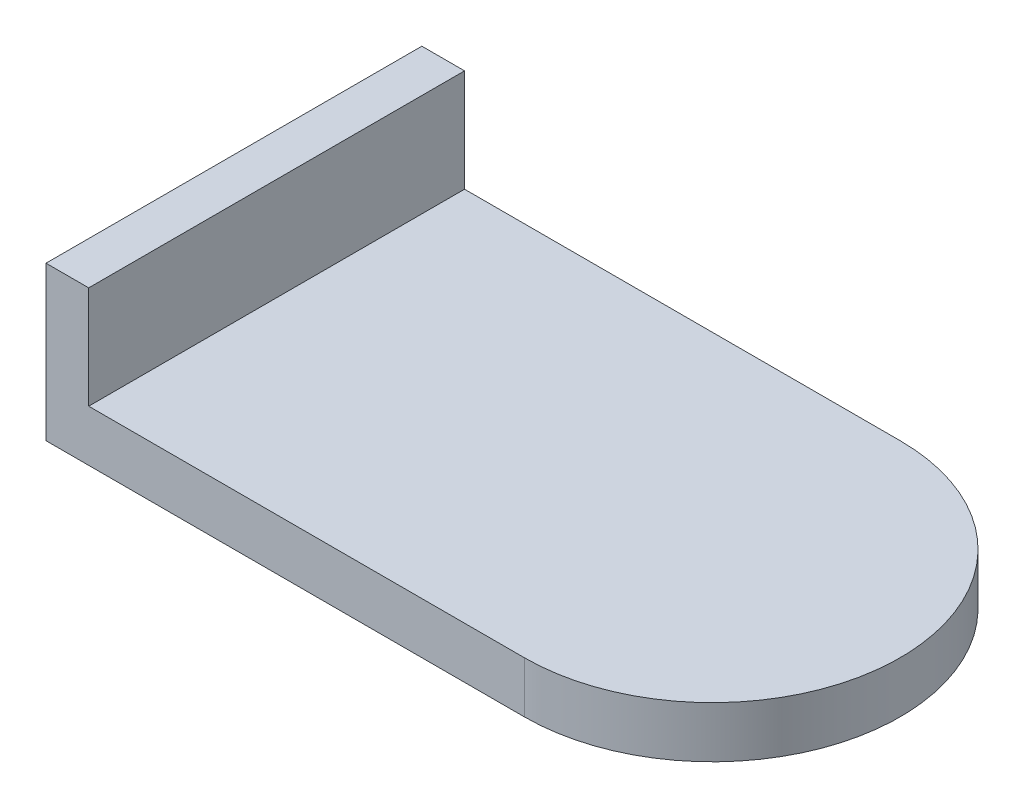
ISO-10303-21;
HEADER;
FILE_DESCRIPTION(('STEP AP214'),'2;1');
FILE_NAME('part.step','',(''),(''),'','','');
FILE_SCHEMA(('AUTOMOTIVE_DESIGN { 1 0 10303 214 1 1 1 1 }'));
ENDSEC;
DATA;
#1=APPLICATION_CONTEXT('core data for automotive mechanical design processes');
#2=APPLICATION_PROTOCOL_DEFINITION('international standard','automotive_design',2000,#1);
#3=PRODUCT_CONTEXT('',#1,'mechanical');
#4=PRODUCT('Part','Part','',(#3));
#5=PRODUCT_RELATED_PRODUCT_CATEGORY('part','',(#4));
#6=PRODUCT_DEFINITION_FORMATION('','',#4);
#7=PRODUCT_DEFINITION_CONTEXT('part definition',#1,'design');
#8=PRODUCT_DEFINITION('design','',#6,#7);
#9=PRODUCT_DEFINITION_SHAPE('','',#8);
#10=(LENGTH_UNIT() NAMED_UNIT(*) SI_UNIT(.MILLI.,.METRE.));
#11=(NAMED_UNIT(*) PLANE_ANGLE_UNIT() SI_UNIT($,.RADIAN.));
#12=(NAMED_UNIT(*) SI_UNIT($,.STERADIAN.) SOLID_ANGLE_UNIT());
#13=UNCERTAINTY_MEASURE_WITH_UNIT(LENGTH_MEASURE(1.E-05),#10,'distance_accuracy_value','');
#14=(GEOMETRIC_REPRESENTATION_CONTEXT(3) GLOBAL_UNCERTAINTY_ASSIGNED_CONTEXT((#13)) GLOBAL_UNIT_ASSIGNED_CONTEXT((#10,
#11,#12)) REPRESENTATION_CONTEXT('',''));
#15=CARTESIAN_POINT('',(0.,0.,0.));
#16=DIRECTION('',(0.,0.,1.));
#17=DIRECTION('',(1.,0.,0.));
#18=AXIS2_PLACEMENT_3D('',#15,#16,#17);
#19=CARTESIAN_POINT('',(14.,3.,0.));
#20=DIRECTION('',(0.,-1.,0.));
#21=DIRECTION('',(0.,0.,-1.));
#22=AXIS2_PLACEMENT_3D('',#19,#20,#21);
#23=CYLINDRICAL_SURFACE('',#22,11.);
#24=DIRECTION('',(0.,1.,0.));
#25=VECTOR('',#24,1.);
#26=CARTESIAN_POINT('',(14.,4.5,-11.));
#27=LINE('',#26,#25);
#28=CARTESIAN_POINT('',(14.,0.,-11.));
#29=VERTEX_POINT('',#28);
#30=CARTESIAN_POINT('',(14.,3.,-11.));
#31=VERTEX_POINT('',#30);
#32=EDGE_CURVE('E67',#29,#31,#27,.T.);
#33=ORIENTED_EDGE('',*,*,#32,.T.);
#34=CARTESIAN_POINT('',(14.,3.,0.));
#35=DIRECTION('',(0.,-1.,0.));
#36=DIRECTION('',(0.,0.,-1.));
#37=AXIS2_PLACEMENT_3D('',#34,#35,#36);
#38=CIRCLE('',#37,11.);
#39=CARTESIAN_POINT('',(14.,3.,11.));
#40=VERTEX_POINT('',#39);
#41=EDGE_CURVE('E95',#40,#31,#38,.F.);
#42=ORIENTED_EDGE('',*,*,#41,.F.);
#43=DIRECTION('',(0.,-1.,0.));
#44=VECTOR('',#43,1.);
#45=CARTESIAN_POINT('',(14.,4.5,11.));
#46=LINE('',#45,#44);
#47=CARTESIAN_POINT('',(14.,0.,11.));
#48=VERTEX_POINT('',#47);
#49=EDGE_CURVE('E80',#40,#48,#46,.T.);
#50=ORIENTED_EDGE('',*,*,#49,.T.);
#51=CARTESIAN_POINT('',(14.,0.,0.));
#52=DIRECTION('',(0.,-1.,0.));
#53=DIRECTION('',(0.,0.,-1.));
#54=AXIS2_PLACEMENT_3D('',#51,#52,#53);
#55=CIRCLE('',#54,11.);
#56=EDGE_CURVE('E20',#48,#29,#55,.F.);
#57=ORIENTED_EDGE('',*,*,#56,.T.);
#58=EDGE_LOOP('',(#33,#42,#50,#57));
#59=FACE_BOUND('',#58,.T.);
#60=ADVANCED_FACE('F16',(#59),#23,.T.);
#61=CARTESIAN_POINT('',(-14.,0.,-11.));
#62=DIRECTION('',(0.,1.,0.));
#63=DIRECTION('',(0.,0.,1.));
#64=AXIS2_PLACEMENT_3D('',#61,#62,#63);
#65=PLANE('',#64);
#66=DIRECTION('',(0.,0.,-1.));
#67=VECTOR('',#66,1.);
#68=CARTESIAN_POINT('',(-14.,0.,0.));
#69=LINE('',#68,#67);
#70=CARTESIAN_POINT('',(-14.,0.,11.));
#71=VERTEX_POINT('',#70);
#72=CARTESIAN_POINT('',(-14.,0.,-11.));
#73=VERTEX_POINT('',#72);
#74=EDGE_CURVE('E85',#71,#73,#69,.T.);
#75=ORIENTED_EDGE('',*,*,#74,.T.);
#76=DIRECTION('',(1.,0.,0.));
#77=VECTOR('',#76,1.);
#78=CARTESIAN_POINT('',(0.,0.,-11.));
#79=LINE('',#78,#77);
#80=EDGE_CURVE('E70',#73,#29,#79,.T.);
#81=ORIENTED_EDGE('',*,*,#80,.T.);
#82=ORIENTED_EDGE('',*,*,#56,.F.);
#83=DIRECTION('',(-1.,0.,0.));
#84=VECTOR('',#83,1.);
#85=CARTESIAN_POINT('',(0.,0.,11.));
#86=LINE('',#85,#84);
#87=EDGE_CURVE('E117',#48,#71,#86,.T.);
#88=ORIENTED_EDGE('',*,*,#87,.T.);
#89=EDGE_LOOP('',(#75,#81,#82,#88));
#90=FACE_BOUND('',#89,.T.);
#91=ADVANCED_FACE('F83',(#90),#65,.F.);
#92=CARTESIAN_POINT('',(14.,0.,11.));
#93=DIRECTION('',(0.,0.,-1.));
#94=DIRECTION('',(-1.,0.,0.));
#95=AXIS2_PLACEMENT_3D('',#92,#93,#94);
#96=PLANE('',#95);
#97=ORIENTED_EDGE('',*,*,#49,.F.);
#98=DIRECTION('',(1.,0.,0.));
#99=VECTOR('',#98,1.);
#100=CARTESIAN_POINT('',(6.8595,3.,11.));
#101=LINE('',#100,#99);
#102=CARTESIAN_POINT('',(-11.5,3.,11.));
#103=VERTEX_POINT('',#102);
#104=EDGE_CURVE('E87',#103,#40,#101,.T.);
#105=ORIENTED_EDGE('',*,*,#104,.F.);
#106=DIRECTION('',(0.,1.,0.));
#107=VECTOR('',#106,1.);
#108=CARTESIAN_POINT('',(-11.5,6.,11.));
#109=LINE('',#108,#107);
#110=CARTESIAN_POINT('',(-11.500000004,9.,11.));
#111=VERTEX_POINT('',#110);
#112=EDGE_CURVE('E113',#103,#111,#109,.T.);
#113=ORIENTED_EDGE('',*,*,#112,.T.);
#114=DIRECTION('',(-1.,0.,0.));
#115=VECTOR('',#114,1.);
#116=CARTESIAN_POINT('',(-12.75,9.,11.));
#117=LINE('',#116,#115);
#118=CARTESIAN_POINT('',(-14.,9.,11.));
#119=VERTEX_POINT('',#118);
#120=EDGE_CURVE('E77',#111,#119,#117,.T.);
#121=ORIENTED_EDGE('',*,*,#120,.T.);
#122=DIRECTION('',(0.,-1.,0.));
#123=VECTOR('',#122,1.);
#124=CARTESIAN_POINT('',(-14.,4.5,11.));
#125=LINE('',#124,#123);
#126=EDGE_CURVE('E114',#119,#71,#125,.T.);
#127=ORIENTED_EDGE('',*,*,#126,.T.);
#128=ORIENTED_EDGE('',*,*,#87,.F.);
#129=EDGE_LOOP('',(#97,#105,#113,#121,#127,#128));
#130=FACE_BOUND('',#129,.T.);
#131=ADVANCED_FACE('F171',(#130),#96,.F.);
#132=CARTESIAN_POINT('',(-14.,9.,11.));
#133=DIRECTION('',(0.,-1.,0.));
#134=DIRECTION('',(0.,0.,-1.));
#135=AXIS2_PLACEMENT_3D('',#132,#133,#134);
#136=PLANE('',#135);
#137=ORIENTED_EDGE('',*,*,#120,.F.);
#138=DIRECTION('',(0.,0.,-1.));
#139=VECTOR('',#138,1.);
#140=CARTESIAN_POINT('',(-11.5,9.,0.));
#141=LINE('',#140,#139);
#142=CARTESIAN_POINT('',(-11.500000002,9.,-11.));
#143=VERTEX_POINT('',#142);
#144=EDGE_CURVE('E147',#111,#143,#141,.T.);
#145=ORIENTED_EDGE('',*,*,#144,.T.);
#146=DIRECTION('',(-1.,0.,0.));
#147=VECTOR('',#146,1.);
#148=CARTESIAN_POINT('',(0.,9.,-11.));
#149=LINE('',#148,#147);
#150=CARTESIAN_POINT('',(-14.,9.,-11.));
#151=VERTEX_POINT('',#150);
#152=EDGE_CURVE('E76',#143,#151,#149,.T.);
#153=ORIENTED_EDGE('',*,*,#152,.T.);
#154=DIRECTION('',(0.,0.,1.));
#155=VECTOR('',#154,1.);
#156=CARTESIAN_POINT('',(-14.,9.,0.));
#157=LINE('',#156,#155);
#158=EDGE_CURVE('E108',#151,#119,#157,.T.);
#159=ORIENTED_EDGE('',*,*,#158,.T.);
#160=EDGE_LOOP('',(#137,#145,#153,#159));
#161=FACE_BOUND('',#160,.T.);
#162=ADVANCED_FACE('F164',(#161),#136,.F.);
#163=CARTESIAN_POINT('',(-14.,0.,-11.));
#164=DIRECTION('',(0.,0.,1.));
#165=DIRECTION('',(1.,0.,0.));
#166=AXIS2_PLACEMENT_3D('',#163,#164,#165);
#167=PLANE('',#166);
#168=DIRECTION('',(0.,1.,0.));
#169=VECTOR('',#168,1.);
#170=CARTESIAN_POINT('',(-14.,4.5,-11.));
#171=LINE('',#170,#169);
#172=EDGE_CURVE('E105',#73,#151,#171,.T.);
#173=ORIENTED_EDGE('',*,*,#172,.T.);
#174=ORIENTED_EDGE('',*,*,#152,.F.);
#175=DIRECTION('',(0.,-1.,0.));
#176=VECTOR('',#175,1.);
#177=CARTESIAN_POINT('',(-11.5,6.,-11.));
#178=LINE('',#177,#176);
#179=CARTESIAN_POINT('',(-11.5,3.,-11.));
#180=VERTEX_POINT('',#179);
#181=EDGE_CURVE('E27',#143,#180,#178,.T.);
#182=ORIENTED_EDGE('',*,*,#181,.T.);
#183=DIRECTION('',(-1.,0.,0.));
#184=VECTOR('',#183,1.);
#185=CARTESIAN_POINT('',(6.8595,3.,-11.));
#186=LINE('',#185,#184);
#187=EDGE_CURVE('E35',#31,#180,#186,.T.);
#188=ORIENTED_EDGE('',*,*,#187,.F.);
#189=ORIENTED_EDGE('',*,*,#32,.F.);
#190=ORIENTED_EDGE('',*,*,#80,.F.);
#191=EDGE_LOOP('',(#173,#174,#182,#188,#189,#190));
#192=FACE_BOUND('',#191,.T.);
#193=ADVANCED_FACE('F69',(#192),#167,.F.);
#194=CARTESIAN_POINT('',(-11.5,3.,-11.));
#195=DIRECTION('',(0.,1.,0.));
#196=DIRECTION('',(0.,0.,1.));
#197=AXIS2_PLACEMENT_3D('',#194,#195,#196);
#198=PLANE('',#197);
#199=ORIENTED_EDGE('',*,*,#41,.T.);
#200=ORIENTED_EDGE('',*,*,#187,.T.);
#201=DIRECTION('',(0.,0.,1.));
#202=VECTOR('',#201,1.);
#203=CARTESIAN_POINT('',(-11.5,3.,0.));
#204=LINE('',#203,#202);
#205=EDGE_CURVE('E11',#180,#103,#204,.T.);
#206=ORIENTED_EDGE('',*,*,#205,.T.);
#207=ORIENTED_EDGE('',*,*,#104,.T.);
#208=EDGE_LOOP('',(#199,#200,#206,#207));
#209=FACE_BOUND('',#208,.T.);
#210=ADVANCED_FACE('F288',(#209),#198,.T.);
#211=CARTESIAN_POINT('',(-14.,0.,11.));
#212=DIRECTION('',(1.,0.,0.));
#213=DIRECTION('',(0.,0.,-1.));
#214=AXIS2_PLACEMENT_3D('',#211,#212,#213);
#215=PLANE('',#214);
#216=ORIENTED_EDGE('',*,*,#126,.F.);
#217=ORIENTED_EDGE('',*,*,#158,.F.);
#218=ORIENTED_EDGE('',*,*,#172,.F.);
#219=ORIENTED_EDGE('',*,*,#74,.F.);
#220=EDGE_LOOP('',(#216,#217,#218,#219));
#221=FACE_BOUND('',#220,.T.);
#222=ADVANCED_FACE('F173',(#221),#215,.F.);
#223=CARTESIAN_POINT('',(-11.5,3.,-11.));
#224=DIRECTION('',(-1.,0.,0.));
#225=DIRECTION('',(0.,0.,1.));
#226=AXIS2_PLACEMENT_3D('',#223,#224,#225);
#227=PLANE('',#226);
#228=ORIENTED_EDGE('',*,*,#181,.F.);
#229=ORIENTED_EDGE('',*,*,#144,.F.);
#230=ORIENTED_EDGE('',*,*,#112,.F.);
#231=ORIENTED_EDGE('',*,*,#205,.F.);
#232=EDGE_LOOP('',(#228,#229,#230,#231));
#233=FACE_BOUND('',#232,.T.);
#234=ADVANCED_FACE('F18',(#233),#227,.F.);
#235=CLOSED_SHELL('',(#60,#91,#131,#162,#193,#210,#222,#234));
#236=MANIFOLD_SOLID_BREP('B1',#235);
#237=ADVANCED_BREP_SHAPE_REPRESENTATION('',(#18,#236),#14);
#238=SHAPE_DEFINITION_REPRESENTATION(#9,#237);
ENDSEC;
END-ISO-10303-21;
